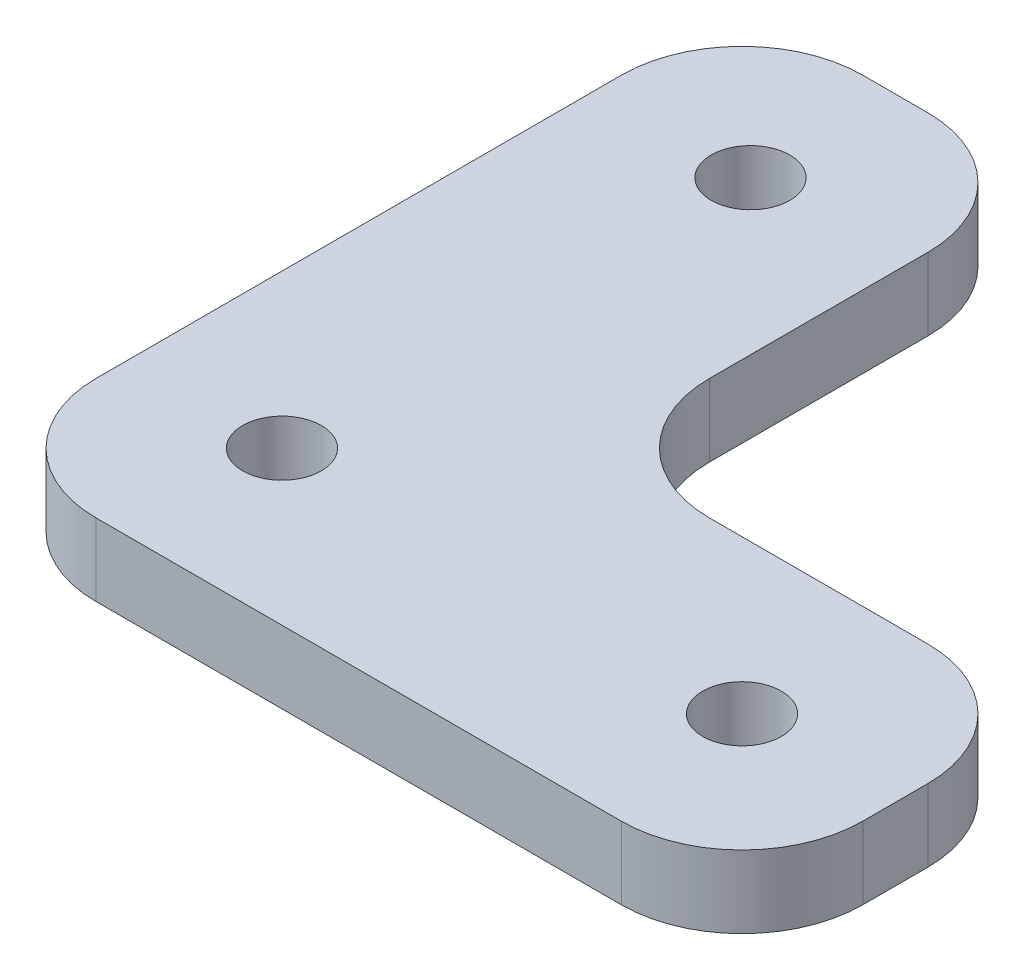
ISO-10303-21;
HEADER;
FILE_DESCRIPTION(('STEP AP214'),'2;1');
FILE_NAME('part.step','',(''),(''),'','','');
FILE_SCHEMA(('AUTOMOTIVE_DESIGN { 1 0 10303 214 1 1 1 1 }'));
ENDSEC;
DATA;
#1=APPLICATION_CONTEXT('core data for automotive mechanical design processes');
#2=APPLICATION_PROTOCOL_DEFINITION('international standard','automotive_design',2000,#1);
#3=PRODUCT_CONTEXT('',#1,'mechanical');
#4=PRODUCT('Part','Part','',(#3));
#5=PRODUCT_RELATED_PRODUCT_CATEGORY('part','',(#4));
#6=PRODUCT_DEFINITION_FORMATION('','',#4);
#7=PRODUCT_DEFINITION_CONTEXT('part definition',#1,'design');
#8=PRODUCT_DEFINITION('design','',#6,#7);
#9=PRODUCT_DEFINITION_SHAPE('','',#8);
#10=(LENGTH_UNIT() NAMED_UNIT(*) SI_UNIT(.MILLI.,.METRE.));
#11=(NAMED_UNIT(*) PLANE_ANGLE_UNIT() SI_UNIT($,.RADIAN.));
#12=(NAMED_UNIT(*) SI_UNIT($,.STERADIAN.) SOLID_ANGLE_UNIT());
#13=UNCERTAINTY_MEASURE_WITH_UNIT(LENGTH_MEASURE(1.E-05),#10,'distance_accuracy_value','');
#14=(GEOMETRIC_REPRESENTATION_CONTEXT(3) GLOBAL_UNCERTAINTY_ASSIGNED_CONTEXT((#13)) GLOBAL_UNIT_ASSIGNED_CONTEXT((#10,
#11,#12)) REPRESENTATION_CONTEXT('',''));
#15=CARTESIAN_POINT('',(0.,0.,0.));
#16=DIRECTION('',(0.,0.,1.));
#17=DIRECTION('',(1.,0.,0.));
#18=AXIS2_PLACEMENT_3D('',#15,#16,#17);
#19=CARTESIAN_POINT('',(0.,6.,0.));
#20=DIRECTION('',(0.,0.,-1.));
#21=DIRECTION('',(-1.,0.,0.));
#22=AXIS2_PLACEMENT_3D('',#19,#20,#21);
#23=PLANE('',#22);
#24=DIRECTION('',(1.,0.,0.));
#25=VECTOR('',#24,1.);
#26=CARTESIAN_POINT('',(0.,0.,0.));
#27=LINE('',#26,#25);
#28=CARTESIAN_POINT('',(10.,0.,0.));
#29=VERTEX_POINT('',#28);
#30=CARTESIAN_POINT('',(53.5,0.,0.));
#31=VERTEX_POINT('',#30);
#32=EDGE_CURVE('E169',#29,#31,#27,.T.);
#33=ORIENTED_EDGE('',*,*,#32,.T.);
#34=DIRECTION('',(0.,-1.,0.));
#35=VECTOR('',#34,1.);
#36=CARTESIAN_POINT('',(53.5,6.,0.));
#37=LINE('',#36,#35);
#38=CARTESIAN_POINT('',(53.5,6.,0.));
#39=VERTEX_POINT('',#38);
#40=EDGE_CURVE('E143',#31,#39,#37,.F.);
#41=ORIENTED_EDGE('',*,*,#40,.T.);
#42=DIRECTION('',(1.,0.,0.));
#43=VECTOR('',#42,1.);
#44=CARTESIAN_POINT('',(0.,6.,0.));
#45=LINE('',#44,#43);
#46=CARTESIAN_POINT('',(10.,6.,0.));
#47=VERTEX_POINT('',#46);
#48=EDGE_CURVE('E348',#47,#39,#45,.T.);
#49=ORIENTED_EDGE('',*,*,#48,.F.);
#50=DIRECTION('',(0.,-1.,0.));
#51=VECTOR('',#50,1.);
#52=CARTESIAN_POINT('',(10.,0.,0.));
#53=LINE('',#52,#51);
#54=EDGE_CURVE('E149',#47,#29,#53,.T.);
#55=ORIENTED_EDGE('',*,*,#54,.T.);
#56=EDGE_LOOP('',(#33,#41,#49,#55));
#57=FACE_BOUND('',#56,.T.);
#58=ADVANCED_FACE('F47',(#57),#23,.F.);
#59=CARTESIAN_POINT('',(63.5,6.,0.));
#60=DIRECTION('',(-1.,0.,0.));
#61=DIRECTION('',(0.,0.,1.));
#62=AXIS2_PLACEMENT_3D('',#59,#60,#61);
#63=PLANE('',#62);
#64=DIRECTION('',(0.,0.,-1.));
#65=VECTOR('',#64,1.);
#66=CARTESIAN_POINT('',(63.5,6.,0.));
#67=LINE('',#66,#65);
#68=CARTESIAN_POINT('',(63.5,6.,-10.));
#69=VERTEX_POINT('',#68);
#70=CARTESIAN_POINT('',(63.5,6.,-15.4));
#71=VERTEX_POINT('',#70);
#72=EDGE_CURVE('E159',#69,#71,#67,.T.);
#73=ORIENTED_EDGE('',*,*,#72,.F.);
#74=DIRECTION('',(0.,-1.,0.));
#75=VECTOR('',#74,1.);
#76=CARTESIAN_POINT('',(63.5,6.,-10.));
#77=LINE('',#76,#75);
#78=CARTESIAN_POINT('',(63.5,0.,-10.));
#79=VERTEX_POINT('',#78);
#80=EDGE_CURVE('E142',#69,#79,#77,.T.);
#81=ORIENTED_EDGE('',*,*,#80,.T.);
#82=DIRECTION('',(0.,0.,-1.));
#83=VECTOR('',#82,1.);
#84=CARTESIAN_POINT('',(63.5,0.,0.));
#85=LINE('',#84,#83);
#86=CARTESIAN_POINT('',(63.5,0.,-15.4));
#87=VERTEX_POINT('',#86);
#88=EDGE_CURVE('E156',#79,#87,#85,.T.);
#89=ORIENTED_EDGE('',*,*,#88,.T.);
#90=DIRECTION('',(0.,-1.,0.));
#91=VECTOR('',#90,1.);
#92=CARTESIAN_POINT('',(63.5,6.,-15.4));
#93=LINE('',#92,#91);
#94=EDGE_CURVE('E162',#87,#71,#93,.F.);
#95=ORIENTED_EDGE('',*,*,#94,.T.);
#96=EDGE_LOOP('',(#73,#81,#89,#95));
#97=FACE_BOUND('',#96,.T.);
#98=ADVANCED_FACE('F155',(#97),#63,.F.);
#99=CARTESIAN_POINT('',(0.,6.,-25.4));
#100=DIRECTION('',(0.,0.,-1.));
#101=DIRECTION('',(-1.,0.,0.));
#102=AXIS2_PLACEMENT_3D('',#99,#100,#101);
#103=PLANE('',#102);
#104=DIRECTION('',(1.,0.,0.));
#105=VECTOR('',#104,1.);
#106=CARTESIAN_POINT('',(0.,6.,-25.4));
#107=LINE('',#106,#105);
#108=CARTESIAN_POINT('',(35.4,6.,-25.4));
#109=VERTEX_POINT('',#108);
#110=CARTESIAN_POINT('',(53.5,6.,-25.4));
#111=VERTEX_POINT('',#110);
#112=EDGE_CURVE('E273',#109,#111,#107,.T.);
#113=ORIENTED_EDGE('',*,*,#112,.T.);
#114=DIRECTION('',(0.,-1.,0.));
#115=VECTOR('',#114,1.);
#116=CARTESIAN_POINT('',(53.5,0.,-25.4));
#117=LINE('',#116,#115);
#118=CARTESIAN_POINT('',(53.5,0.,-25.4));
#119=VERTEX_POINT('',#118);
#120=EDGE_CURVE('E230',#111,#119,#117,.T.);
#121=ORIENTED_EDGE('',*,*,#120,.T.);
#122=DIRECTION('',(1.,0.,0.));
#123=VECTOR('',#122,1.);
#124=CARTESIAN_POINT('',(0.,0.,-25.4));
#125=LINE('',#124,#123);
#126=CARTESIAN_POINT('',(35.4,0.,-25.4));
#127=VERTEX_POINT('',#126);
#128=EDGE_CURVE('E168',#127,#119,#125,.T.);
#129=ORIENTED_EDGE('',*,*,#128,.F.);
#130=DIRECTION('',(0.,-1.,0.));
#131=VECTOR('',#130,1.);
#132=CARTESIAN_POINT('',(35.4,6.,-25.4));
#133=LINE('',#132,#131);
#134=EDGE_CURVE('E227',#127,#109,#133,.F.);
#135=ORIENTED_EDGE('',*,*,#134,.T.);
#136=EDGE_LOOP('',(#113,#121,#129,#135));
#137=FACE_BOUND('',#136,.T.);
#138=ADVANCED_FACE('F261',(#137),#103,.T.);
#139=CARTESIAN_POINT('',(25.4,6.,0.));
#140=DIRECTION('',(-1.,0.,0.));
#141=DIRECTION('',(0.,0.,1.));
#142=AXIS2_PLACEMENT_3D('',#139,#140,#141);
#143=PLANE('',#142);
#144=DIRECTION('',(0.,0.,-1.));
#145=VECTOR('',#144,1.);
#146=CARTESIAN_POINT('',(25.4,6.,0.));
#147=LINE('',#146,#145);
#148=CARTESIAN_POINT('',(25.4,6.,-35.4));
#149=VERTEX_POINT('',#148);
#150=CARTESIAN_POINT('',(25.4,6.,-53.5));
#151=VERTEX_POINT('',#150);
#152=EDGE_CURVE('E271',#149,#151,#147,.T.);
#153=ORIENTED_EDGE('',*,*,#152,.F.);
#154=DIRECTION('',(0.,-1.,0.));
#155=VECTOR('',#154,1.);
#156=CARTESIAN_POINT('',(25.4,6.,-35.4));
#157=LINE('',#156,#155);
#158=CARTESIAN_POINT('',(25.4,0.,-35.4));
#159=VERTEX_POINT('',#158);
#160=EDGE_CURVE('E237',#149,#159,#157,.T.);
#161=ORIENTED_EDGE('',*,*,#160,.T.);
#162=DIRECTION('',(0.,0.,-1.));
#163=VECTOR('',#162,1.);
#164=CARTESIAN_POINT('',(25.4,0.,0.));
#165=LINE('',#164,#163);
#166=CARTESIAN_POINT('',(25.4,0.,-53.5));
#167=VERTEX_POINT('',#166);
#168=EDGE_CURVE('E173',#159,#167,#165,.T.);
#169=ORIENTED_EDGE('',*,*,#168,.T.);
#170=DIRECTION('',(0.,-1.,0.));
#171=VECTOR('',#170,1.);
#172=CARTESIAN_POINT('',(25.4,6.,-53.5));
#173=LINE('',#172,#171);
#174=EDGE_CURVE('E234',#167,#151,#173,.F.);
#175=ORIENTED_EDGE('',*,*,#174,.T.);
#176=EDGE_LOOP('',(#153,#161,#169,#175));
#177=FACE_BOUND('',#176,.T.);
#178=ADVANCED_FACE('F275',(#177),#143,.F.);
#179=CARTESIAN_POINT('',(0.,6.,-63.5));
#180=DIRECTION('',(0.,0.,-1.));
#181=DIRECTION('',(-1.,0.,0.));
#182=AXIS2_PLACEMENT_3D('',#179,#180,#181);
#183=PLANE('',#182);
#184=DIRECTION('',(1.,0.,0.));
#185=VECTOR('',#184,1.);
#186=CARTESIAN_POINT('',(0.,6.,-63.5));
#187=LINE('',#186,#185);
#188=CARTESIAN_POINT('',(10.,6.,-63.5));
#189=VERTEX_POINT('',#188);
#190=CARTESIAN_POINT('',(15.4,6.,-63.5));
#191=VERTEX_POINT('',#190);
#192=EDGE_CURVE('E278',#189,#191,#187,.T.);
#193=ORIENTED_EDGE('',*,*,#192,.T.);
#194=DIRECTION('',(0.,-1.,0.));
#195=VECTOR('',#194,1.);
#196=CARTESIAN_POINT('',(15.4,0.,-63.5));
#197=LINE('',#196,#195);
#198=CARTESIAN_POINT('',(15.4,0.,-63.5));
#199=VERTEX_POINT('',#198);
#200=EDGE_CURVE('E244',#191,#199,#197,.T.);
#201=ORIENTED_EDGE('',*,*,#200,.T.);
#202=DIRECTION('',(1.,0.,0.));
#203=VECTOR('',#202,1.);
#204=CARTESIAN_POINT('',(0.,0.,-63.5));
#205=LINE('',#204,#203);
#206=CARTESIAN_POINT('',(10.,0.,-63.5));
#207=VERTEX_POINT('',#206);
#208=EDGE_CURVE('E182',#207,#199,#205,.T.);
#209=ORIENTED_EDGE('',*,*,#208,.F.);
#210=DIRECTION('',(0.,-1.,0.));
#211=VECTOR('',#210,1.);
#212=CARTESIAN_POINT('',(10.,6.,-63.5));
#213=LINE('',#212,#211);
#214=EDGE_CURVE('E241',#207,#189,#213,.F.);
#215=ORIENTED_EDGE('',*,*,#214,.T.);
#216=EDGE_LOOP('',(#193,#201,#209,#215));
#217=FACE_BOUND('',#216,.T.);
#218=ADVANCED_FACE('F314',(#217),#183,.T.);
#219=CARTESIAN_POINT('',(0.,6.,0.));
#220=DIRECTION('',(-1.,0.,0.));
#221=DIRECTION('',(0.,0.,1.));
#222=AXIS2_PLACEMENT_3D('',#219,#220,#221);
#223=PLANE('',#222);
#224=DIRECTION('',(0.,0.,-1.));
#225=VECTOR('',#224,1.);
#226=CARTESIAN_POINT('',(0.,6.,0.));
#227=LINE('',#226,#225);
#228=CARTESIAN_POINT('',(0.,6.,-10.));
#229=VERTEX_POINT('',#228);
#230=CARTESIAN_POINT('',(0.,6.,-53.5));
#231=VERTEX_POINT('',#230);
#232=EDGE_CURVE('E283',#229,#231,#227,.T.);
#233=ORIENTED_EDGE('',*,*,#232,.T.);
#234=DIRECTION('',(0.,-1.,0.));
#235=VECTOR('',#234,1.);
#236=CARTESIAN_POINT('',(0.,6.,-53.5));
#237=LINE('',#236,#235);
#238=CARTESIAN_POINT('',(0.,0.,-53.5));
#239=VERTEX_POINT('',#238);
#240=EDGE_CURVE('E250',#231,#239,#237,.T.);
#241=ORIENTED_EDGE('',*,*,#240,.T.);
#242=DIRECTION('',(0.,0.,-1.));
#243=VECTOR('',#242,1.);
#244=CARTESIAN_POINT('',(0.,0.,0.));
#245=LINE('',#244,#243);
#246=CARTESIAN_POINT('',(0.,0.,-10.));
#247=VERTEX_POINT('',#246);
#248=EDGE_CURVE('E186',#247,#239,#245,.T.);
#249=ORIENTED_EDGE('',*,*,#248,.F.);
#250=DIRECTION('',(0.,-1.,0.));
#251=VECTOR('',#250,1.);
#252=CARTESIAN_POINT('',(0.,6.,-10.));
#253=LINE('',#252,#251);
#254=EDGE_CURVE('E70',#247,#229,#253,.F.);
#255=ORIENTED_EDGE('',*,*,#254,.T.);
#256=EDGE_LOOP('',(#233,#241,#249,#255));
#257=FACE_BOUND('',#256,.T.);
#258=ADVANCED_FACE('F304',(#257),#223,.T.);
#259=CARTESIAN_POINT('',(12.7,6.,-51.5));
#260=DIRECTION('',(0.,-1.,0.));
#261=DIRECTION('',(0.,0.,-1.));
#262=AXIS2_PLACEMENT_3D('',#259,#260,#261);
#263=CYLINDRICAL_SURFACE('',#262,3.25755);
#264=CARTESIAN_POINT('',(12.7,6.,-51.5));
#265=DIRECTION('',(0.,1.,0.));
#266=DIRECTION('',(0.,0.,1.));
#267=AXIS2_PLACEMENT_3D('',#264,#265,#266);
#268=CIRCLE('',#267,3.25755);
#269=CARTESIAN_POINT('',(12.7,6.,-48.24245));
#270=VERTEX_POINT('',#269);
#271=EDGE_CURVE('E346',#270,#270,#268,.T.);
#272=ORIENTED_EDGE('',*,*,#271,.T.);
#273=EDGE_LOOP('',(#272));
#274=FACE_BOUND('',#273,.T.);
#275=CARTESIAN_POINT('',(12.7,0.,-51.5));
#276=DIRECTION('',(0.,1.,0.));
#277=DIRECTION('',(0.,0.,1.));
#278=AXIS2_PLACEMENT_3D('',#275,#276,#277);
#279=CIRCLE('',#278,3.25755);
#280=CARTESIAN_POINT('',(12.7,0.,-48.24245));
#281=VERTEX_POINT('',#280);
#282=EDGE_CURVE('E175',#281,#281,#279,.T.);
#283=ORIENTED_EDGE('',*,*,#282,.F.);
#284=EDGE_LOOP('',(#283));
#285=FACE_BOUND('',#284,.T.);
#286=ADVANCED_FACE('F301',(#274,#285),#263,.F.);
#287=CARTESIAN_POINT('',(12.7,6.,-12.7));
#288=DIRECTION('',(0.,-1.,0.));
#289=DIRECTION('',(0.,0.,-1.));
#290=AXIS2_PLACEMENT_3D('',#287,#288,#289);
#291=CYLINDRICAL_SURFACE('',#290,3.25755);
#292=CARTESIAN_POINT('',(12.7,6.,-12.7));
#293=DIRECTION('',(0.,1.,0.));
#294=DIRECTION('',(0.,0.,1.));
#295=AXIS2_PLACEMENT_3D('',#292,#293,#294);
#296=CIRCLE('',#295,3.25755);
#297=CARTESIAN_POINT('',(12.7,6.,-9.44245));
#298=VERTEX_POINT('',#297);
#299=EDGE_CURVE('E194',#298,#298,#296,.T.);
#300=ORIENTED_EDGE('',*,*,#299,.T.);
#301=EDGE_LOOP('',(#300));
#302=FACE_BOUND('',#301,.T.);
#303=CARTESIAN_POINT('',(12.7,0.,-12.7));
#304=DIRECTION('',(0.,1.,0.));
#305=DIRECTION('',(0.,0.,1.));
#306=AXIS2_PLACEMENT_3D('',#303,#304,#305);
#307=CIRCLE('',#306,3.25755);
#308=CARTESIAN_POINT('',(12.7,0.,-9.44245));
#309=VERTEX_POINT('',#308);
#310=EDGE_CURVE('E293',#309,#309,#307,.T.);
#311=ORIENTED_EDGE('',*,*,#310,.F.);
#312=EDGE_LOOP('',(#311));
#313=FACE_BOUND('',#312,.T.);
#314=ADVANCED_FACE('F303',(#302,#313),#291,.F.);
#315=CARTESIAN_POINT('',(50.8,6.,-12.7));
#316=DIRECTION('',(0.,-1.,0.));
#317=DIRECTION('',(0.,0.,-1.));
#318=AXIS2_PLACEMENT_3D('',#315,#316,#317);
#319=CYLINDRICAL_SURFACE('',#318,3.25755);
#320=CARTESIAN_POINT('',(50.8,6.,-12.7));
#321=DIRECTION('',(0.,1.,0.));
#322=DIRECTION('',(0.,0.,1.));
#323=AXIS2_PLACEMENT_3D('',#320,#321,#322);
#324=CIRCLE('',#323,3.25755);
#325=CARTESIAN_POINT('',(50.8,6.,-9.44245));
#326=VERTEX_POINT('',#325);
#327=EDGE_CURVE('E196',#326,#326,#324,.T.);
#328=ORIENTED_EDGE('',*,*,#327,.T.);
#329=EDGE_LOOP('',(#328));
#330=FACE_BOUND('',#329,.T.);
#331=CARTESIAN_POINT('',(50.8,0.,-12.7));
#332=DIRECTION('',(0.,1.,0.));
#333=DIRECTION('',(0.,0.,1.));
#334=AXIS2_PLACEMENT_3D('',#331,#332,#333);
#335=CIRCLE('',#334,3.25755);
#336=CARTESIAN_POINT('',(50.8,0.,-9.44245));
#337=VERTEX_POINT('',#336);
#338=EDGE_CURVE('E190',#337,#337,#335,.T.);
#339=ORIENTED_EDGE('',*,*,#338,.F.);
#340=EDGE_LOOP('',(#339));
#341=FACE_BOUND('',#340,.T.);
#342=ADVANCED_FACE('F310',(#330,#341),#319,.F.);
#343=CARTESIAN_POINT('',(0.,6.,0.));
#344=DIRECTION('',(0.,1.,0.));
#345=DIRECTION('',(0.,0.,1.));
#346=AXIS2_PLACEMENT_3D('',#343,#344,#345);
#347=PLANE('',#346);
#348=ORIENTED_EDGE('',*,*,#299,.F.);
#349=EDGE_LOOP('',(#348));
#350=FACE_BOUND('',#349,.T.);
#351=ORIENTED_EDGE('',*,*,#271,.F.);
#352=EDGE_LOOP('',(#351));
#353=FACE_BOUND('',#352,.T.);
#354=ORIENTED_EDGE('',*,*,#48,.T.);
#355=CARTESIAN_POINT('',(53.5,6.,-10.));
#356=DIRECTION('',(0.,1.,0.));
#357=DIRECTION('',(0.,0.,1.));
#358=AXIS2_PLACEMENT_3D('',#355,#356,#357);
#359=CIRCLE('',#358,10.);
#360=EDGE_CURVE('E224',#39,#69,#359,.T.);
#361=ORIENTED_EDGE('',*,*,#360,.T.);
#362=ORIENTED_EDGE('',*,*,#72,.T.);
#363=CARTESIAN_POINT('',(53.5,6.,-15.4));
#364=DIRECTION('',(0.,1.,0.));
#365=DIRECTION('',(0.,0.,1.));
#366=AXIS2_PLACEMENT_3D('',#363,#364,#365);
#367=CIRCLE('',#366,10.);
#368=EDGE_CURVE('E221',#71,#111,#367,.T.);
#369=ORIENTED_EDGE('',*,*,#368,.T.);
#370=ORIENTED_EDGE('',*,*,#112,.F.);
#371=CARTESIAN_POINT('',(35.4,6.,-35.4));
#372=DIRECTION('',(0.,1.,0.));
#373=DIRECTION('',(0.,0.,1.));
#374=AXIS2_PLACEMENT_3D('',#371,#372,#373);
#375=CIRCLE('',#374,10.);
#376=EDGE_CURVE('E11',#109,#149,#375,.F.);
#377=ORIENTED_EDGE('',*,*,#376,.T.);
#378=ORIENTED_EDGE('',*,*,#152,.T.);
#379=CARTESIAN_POINT('',(15.4,6.,-53.5));
#380=DIRECTION('',(0.,1.,0.));
#381=DIRECTION('',(0.,0.,1.));
#382=AXIS2_PLACEMENT_3D('',#379,#380,#381);
#383=CIRCLE('',#382,10.);
#384=EDGE_CURVE('E218',#151,#191,#383,.T.);
#385=ORIENTED_EDGE('',*,*,#384,.T.);
#386=ORIENTED_EDGE('',*,*,#192,.F.);
#387=CARTESIAN_POINT('',(10.,6.,-53.5));
#388=DIRECTION('',(0.,1.,0.));
#389=DIRECTION('',(0.,0.,1.));
#390=AXIS2_PLACEMENT_3D('',#387,#388,#389);
#391=CIRCLE('',#390,10.);
#392=EDGE_CURVE('E63',#189,#231,#391,.T.);
#393=ORIENTED_EDGE('',*,*,#392,.T.);
#394=ORIENTED_EDGE('',*,*,#232,.F.);
#395=CARTESIAN_POINT('',(10.,6.,-10.));
#396=DIRECTION('',(0.,1.,0.));
#397=DIRECTION('',(0.,0.,1.));
#398=AXIS2_PLACEMENT_3D('',#395,#396,#397);
#399=CIRCLE('',#398,10.);
#400=EDGE_CURVE('E213',#229,#47,#399,.T.);
#401=ORIENTED_EDGE('',*,*,#400,.T.);
#402=EDGE_LOOP('',(#354,#361,#362,#369,#370,#377,#378,#385,#386,#393,#394,#401));
#403=FACE_BOUND('',#402,.T.);
#404=ORIENTED_EDGE('',*,*,#327,.F.);
#405=EDGE_LOOP('',(#404));
#406=FACE_BOUND('',#405,.T.);
#407=ADVANCED_FACE('F269',(#350,#353,#403,#406),#347,.T.);
#408=CARTESIAN_POINT('',(0.,0.,0.));
#409=DIRECTION('',(0.,1.,0.));
#410=DIRECTION('',(0.,0.,1.));
#411=AXIS2_PLACEMENT_3D('',#408,#409,#410);
#412=PLANE('',#411);
#413=ORIENTED_EDGE('',*,*,#310,.T.);
#414=EDGE_LOOP('',(#413));
#415=FACE_BOUND('',#414,.T.);
#416=ORIENTED_EDGE('',*,*,#282,.T.);
#417=EDGE_LOOP('',(#416));
#418=FACE_BOUND('',#417,.T.);
#419=ORIENTED_EDGE('',*,*,#88,.F.);
#420=CARTESIAN_POINT('',(53.5,0.,-10.));
#421=DIRECTION('',(0.,1.,0.));
#422=DIRECTION('',(0.,0.,1.));
#423=AXIS2_PLACEMENT_3D('',#420,#421,#422);
#424=CIRCLE('',#423,10.);
#425=EDGE_CURVE('E138',#79,#31,#424,.F.);
#426=ORIENTED_EDGE('',*,*,#425,.T.);
#427=ORIENTED_EDGE('',*,*,#32,.F.);
#428=CARTESIAN_POINT('',(10.,0.,-10.));
#429=DIRECTION('',(0.,1.,0.));
#430=DIRECTION('',(0.,0.,1.));
#431=AXIS2_PLACEMENT_3D('',#428,#429,#430);
#432=CIRCLE('',#431,10.);
#433=EDGE_CURVE('E161',#29,#247,#432,.F.);
#434=ORIENTED_EDGE('',*,*,#433,.T.);
#435=ORIENTED_EDGE('',*,*,#248,.T.);
#436=CARTESIAN_POINT('',(10.,0.,-53.5));
#437=DIRECTION('',(0.,1.,0.));
#438=DIRECTION('',(0.,0.,1.));
#439=AXIS2_PLACEMENT_3D('',#436,#437,#438);
#440=CIRCLE('',#439,10.);
#441=EDGE_CURVE('E200',#239,#207,#440,.F.);
#442=ORIENTED_EDGE('',*,*,#441,.T.);
#443=ORIENTED_EDGE('',*,*,#208,.T.);
#444=CARTESIAN_POINT('',(15.4,0.,-53.5));
#445=DIRECTION('',(0.,1.,0.));
#446=DIRECTION('',(0.,0.,1.));
#447=AXIS2_PLACEMENT_3D('',#444,#445,#446);
#448=CIRCLE('',#447,10.);
#449=EDGE_CURVE('E203',#199,#167,#448,.F.);
#450=ORIENTED_EDGE('',*,*,#449,.T.);
#451=ORIENTED_EDGE('',*,*,#168,.F.);
#452=CARTESIAN_POINT('',(35.4,0.,-35.4));
#453=DIRECTION('',(0.,1.,0.));
#454=DIRECTION('',(0.,0.,1.));
#455=AXIS2_PLACEMENT_3D('',#452,#453,#454);
#456=CIRCLE('',#455,10.);
#457=EDGE_CURVE('E56',#159,#127,#456,.T.);
#458=ORIENTED_EDGE('',*,*,#457,.T.);
#459=ORIENTED_EDGE('',*,*,#128,.T.);
#460=CARTESIAN_POINT('',(53.5,0.,-15.4));
#461=DIRECTION('',(0.,1.,0.));
#462=DIRECTION('',(0.,0.,1.));
#463=AXIS2_PLACEMENT_3D('',#460,#461,#462);
#464=CIRCLE('',#463,10.);
#465=EDGE_CURVE('E150',#119,#87,#464,.F.);
#466=ORIENTED_EDGE('',*,*,#465,.T.);
#467=EDGE_LOOP('',(#419,#426,#427,#434,#435,#442,#443,#450,#451,#458,#459,#466));
#468=FACE_BOUND('',#467,.T.);
#469=ORIENTED_EDGE('',*,*,#338,.T.);
#470=EDGE_LOOP('',(#469));
#471=FACE_BOUND('',#470,.T.);
#472=ADVANCED_FACE('F164',(#415,#418,#468,#471),#412,.F.);
#473=CARTESIAN_POINT('',(53.5,6.,-10.));
#474=DIRECTION('',(0.,-1.,0.));
#475=DIRECTION('',(0.,0.,-1.));
#476=AXIS2_PLACEMENT_3D('',#473,#474,#475);
#477=CYLINDRICAL_SURFACE('',#476,10.);
#478=ORIENTED_EDGE('',*,*,#360,.F.);
#479=ORIENTED_EDGE('',*,*,#40,.F.);
#480=ORIENTED_EDGE('',*,*,#425,.F.);
#481=ORIENTED_EDGE('',*,*,#80,.F.);
#482=EDGE_LOOP('',(#478,#479,#480,#481));
#483=FACE_BOUND('',#482,.T.);
#484=ADVANCED_FACE('F141',(#483),#477,.T.);
#485=CARTESIAN_POINT('',(53.5,6.,-15.4));
#486=DIRECTION('',(0.,1.,0.));
#487=DIRECTION('',(0.,0.,1.));
#488=AXIS2_PLACEMENT_3D('',#485,#486,#487);
#489=CYLINDRICAL_SURFACE('',#488,10.);
#490=ORIENTED_EDGE('',*,*,#368,.F.);
#491=ORIENTED_EDGE('',*,*,#94,.F.);
#492=ORIENTED_EDGE('',*,*,#465,.F.);
#493=ORIENTED_EDGE('',*,*,#120,.F.);
#494=EDGE_LOOP('',(#490,#491,#492,#493));
#495=FACE_BOUND('',#494,.T.);
#496=ADVANCED_FACE('F357',(#495),#489,.T.);
#497=CARTESIAN_POINT('',(35.4,6.,-35.4));
#498=DIRECTION('',(0.,-1.,0.));
#499=DIRECTION('',(0.,0.,-1.));
#500=AXIS2_PLACEMENT_3D('',#497,#498,#499);
#501=CYLINDRICAL_SURFACE('',#500,10.);
#502=ORIENTED_EDGE('',*,*,#376,.F.);
#503=ORIENTED_EDGE('',*,*,#134,.F.);
#504=ORIENTED_EDGE('',*,*,#457,.F.);
#505=ORIENTED_EDGE('',*,*,#160,.F.);
#506=EDGE_LOOP('',(#502,#503,#504,#505));
#507=FACE_BOUND('',#506,.T.);
#508=ADVANCED_FACE('F265',(#507),#501,.F.);
#509=CARTESIAN_POINT('',(15.4,6.,-53.5));
#510=DIRECTION('',(0.,1.,0.));
#511=DIRECTION('',(0.,0.,1.));
#512=AXIS2_PLACEMENT_3D('',#509,#510,#511);
#513=CYLINDRICAL_SURFACE('',#512,10.);
#514=ORIENTED_EDGE('',*,*,#384,.F.);
#515=ORIENTED_EDGE('',*,*,#174,.F.);
#516=ORIENTED_EDGE('',*,*,#449,.F.);
#517=ORIENTED_EDGE('',*,*,#200,.F.);
#518=EDGE_LOOP('',(#514,#515,#516,#517));
#519=FACE_BOUND('',#518,.T.);
#520=ADVANCED_FACE('F364',(#519),#513,.T.);
#521=CARTESIAN_POINT('',(10.,6.,-53.5));
#522=DIRECTION('',(0.,-1.,0.));
#523=DIRECTION('',(0.,0.,-1.));
#524=AXIS2_PLACEMENT_3D('',#521,#522,#523);
#525=CYLINDRICAL_SURFACE('',#524,10.);
#526=ORIENTED_EDGE('',*,*,#392,.F.);
#527=ORIENTED_EDGE('',*,*,#214,.F.);
#528=ORIENTED_EDGE('',*,*,#441,.F.);
#529=ORIENTED_EDGE('',*,*,#240,.F.);
#530=EDGE_LOOP('',(#526,#527,#528,#529));
#531=FACE_BOUND('',#530,.T.);
#532=ADVANCED_FACE('F369',(#531),#525,.T.);
#533=CARTESIAN_POINT('',(10.,6.,-10.));
#534=DIRECTION('',(0.,1.,0.));
#535=DIRECTION('',(0.,0.,1.));
#536=AXIS2_PLACEMENT_3D('',#533,#534,#535);
#537=CYLINDRICAL_SURFACE('',#536,10.);
#538=ORIENTED_EDGE('',*,*,#400,.F.);
#539=ORIENTED_EDGE('',*,*,#254,.F.);
#540=ORIENTED_EDGE('',*,*,#433,.F.);
#541=ORIENTED_EDGE('',*,*,#54,.F.);
#542=EDGE_LOOP('',(#538,#539,#540,#541));
#543=FACE_BOUND('',#542,.T.);
#544=ADVANCED_FACE('F49',(#543),#537,.T.);
#545=CLOSED_SHELL('',(#58,#98,#138,#178,#218,#258,#286,#314,#342,#407,#472,#484,#496,#508,#520,
#532,#544));
#546=MANIFOLD_SOLID_BREP('B2',#545);
#547=ADVANCED_BREP_SHAPE_REPRESENTATION('',(#18,#546),#14);
#548=SHAPE_DEFINITION_REPRESENTATION(#9,#547);
ENDSEC;
END-ISO-10303-21;
